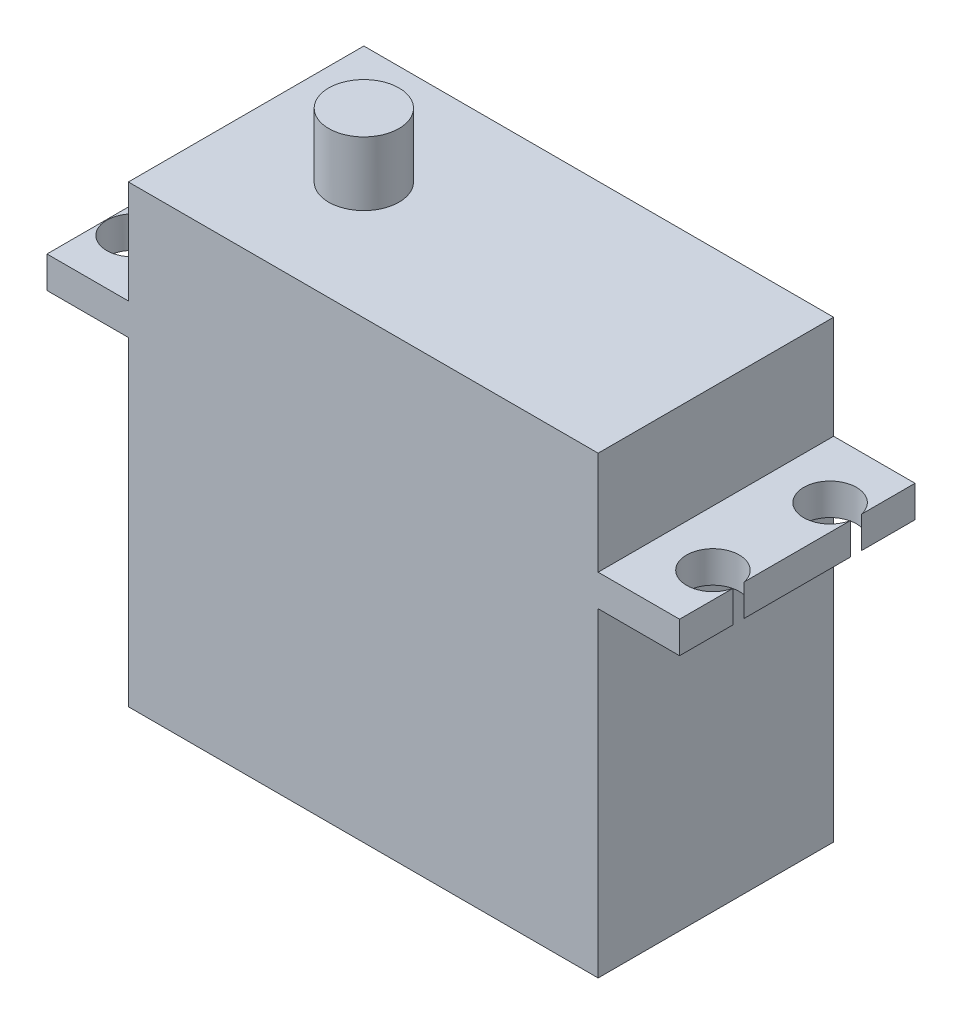
ISO-10303-21;
HEADER;
FILE_DESCRIPTION(('STEP AP214'),'2;1');
FILE_NAME('part.step','',(''),(''),'','','');
FILE_SCHEMA(('AUTOMOTIVE_DESIGN { 1 0 10303 214 1 1 1 1 }'));
ENDSEC;
DATA;
#1=APPLICATION_CONTEXT('core data for automotive mechanical design processes');
#2=APPLICATION_PROTOCOL_DEFINITION('international standard','automotive_design',2000,#1);
#3=PRODUCT_CONTEXT('',#1,'mechanical');
#4=PRODUCT('Part','Part','',(#3));
#5=PRODUCT_RELATED_PRODUCT_CATEGORY('part','',(#4));
#6=PRODUCT_DEFINITION_FORMATION('','',#4);
#7=PRODUCT_DEFINITION_CONTEXT('part definition',#1,'design');
#8=PRODUCT_DEFINITION('design','',#6,#7);
#9=PRODUCT_DEFINITION_SHAPE('','',#8);
#10=(LENGTH_UNIT() NAMED_UNIT(*) SI_UNIT(.MILLI.,.METRE.));
#11=(NAMED_UNIT(*) PLANE_ANGLE_UNIT() SI_UNIT($,.RADIAN.));
#12=(NAMED_UNIT(*) SI_UNIT($,.STERADIAN.) SOLID_ANGLE_UNIT());
#13=UNCERTAINTY_MEASURE_WITH_UNIT(LENGTH_MEASURE(1.E-05),#10,'distance_accuracy_value','');
#14=(GEOMETRIC_REPRESENTATION_CONTEXT(3) GLOBAL_UNCERTAINTY_ASSIGNED_CONTEXT((#13)) GLOBAL_UNIT_ASSIGNED_CONTEXT((#10,
#11,#12)) REPRESENTATION_CONTEXT('',''));
#15=CARTESIAN_POINT('',(0.,0.,0.));
#16=DIRECTION('',(0.,0.,1.));
#17=DIRECTION('',(1.,0.,0.));
#18=AXIS2_PLACEMENT_3D('',#15,#16,#17);
#19=CARTESIAN_POINT('',(-20.05,38.8,-10.05));
#20=DIRECTION('',(1.,0.,0.));
#21=DIRECTION('',(0.,0.,-1.));
#22=AXIS2_PLACEMENT_3D('',#19,#20,#21);
#23=PLANE('',#22);
#24=DIRECTION('',(0.,0.,1.));
#25=VECTOR('',#24,1.);
#26=CARTESIAN_POINT('',(-20.05,27.3,-10.05));
#27=LINE('',#26,#25);
#28=CARTESIAN_POINT('',(-20.05,27.3,-10.05));
#29=VERTEX_POINT('',#28);
#30=CARTESIAN_POINT('',(-20.05,27.3,10.05));
#31=VERTEX_POINT('',#30);
#32=EDGE_CURVE('E238',#29,#31,#27,.T.);
#33=ORIENTED_EDGE('',*,*,#32,.F.);
#34=DIRECTION('',(0.,-1.,0.));
#35=VECTOR('',#34,1.);
#36=CARTESIAN_POINT('',(-20.05,38.8,-10.05));
#37=LINE('',#36,#35);
#38=CARTESIAN_POINT('',(-20.05,0.,-10.05));
#39=VERTEX_POINT('',#38);
#40=EDGE_CURVE('E308',#29,#39,#37,.T.);
#41=ORIENTED_EDGE('',*,*,#40,.T.);
#42=DIRECTION('',(0.,0.,1.));
#43=VECTOR('',#42,1.);
#44=CARTESIAN_POINT('',(-20.05,0.,-10.05));
#45=LINE('',#44,#43);
#46=CARTESIAN_POINT('',(-20.05,0.,10.05));
#47=VERTEX_POINT('',#46);
#48=EDGE_CURVE('E297',#39,#47,#45,.T.);
#49=ORIENTED_EDGE('',*,*,#48,.T.);
#50=DIRECTION('',(0.,-1.,0.));
#51=VECTOR('',#50,1.);
#52=CARTESIAN_POINT('',(-20.05,38.8,10.05));
#53=LINE('',#52,#51);
#54=EDGE_CURVE('E304',#31,#47,#53,.T.);
#55=ORIENTED_EDGE('',*,*,#54,.F.);
#56=EDGE_LOOP('',(#33,#41,#49,#55));
#57=FACE_BOUND('',#56,.T.);
#58=DIRECTION('',(0.,1.,0.));
#59=VECTOR('',#58,1.);
#60=CARTESIAN_POINT('',(-20.05,11.,3.99999999999999));
#61=LINE('',#60,#59);
#62=CARTESIAN_POINT('',(-20.05,7.,3.99999999999999));
#63=VERTEX_POINT('',#62);
#64=CARTESIAN_POINT('',(-20.05,11.,3.99999999999999));
#65=VERTEX_POINT('',#64);
#66=EDGE_CURVE('E191',#63,#65,#61,.T.);
#67=ORIENTED_EDGE('',*,*,#66,.F.);
#68=DIRECTION('',(0.,0.,1.));
#69=VECTOR('',#68,1.);
#70=CARTESIAN_POINT('',(-20.05,7.,-4.00000000000001));
#71=LINE('',#70,#69);
#72=CARTESIAN_POINT('',(-20.05,7.,-4.00000000000001));
#73=VERTEX_POINT('',#72);
#74=EDGE_CURVE('E188',#73,#63,#71,.T.);
#75=ORIENTED_EDGE('',*,*,#74,.F.);
#76=DIRECTION('',(0.,-1.,0.));
#77=VECTOR('',#76,1.);
#78=CARTESIAN_POINT('',(-20.05,11.,-4.00000000000001));
#79=LINE('',#78,#77);
#80=CARTESIAN_POINT('',(-20.05,11.,-4.00000000000001));
#81=VERTEX_POINT('',#80);
#82=EDGE_CURVE('E54',#81,#73,#79,.T.);
#83=ORIENTED_EDGE('',*,*,#82,.F.);
#84=DIRECTION('',(0.,0.,-1.));
#85=VECTOR('',#84,1.);
#86=CARTESIAN_POINT('',(-20.05,11.,-4.00000000000001));
#87=LINE('',#86,#85);
#88=EDGE_CURVE('E49',#65,#81,#87,.T.);
#89=ORIENTED_EDGE('',*,*,#88,.F.);
#90=EDGE_LOOP('',(#67,#75,#83,#89));
#91=FACE_BOUND('',#90,.T.);
#92=ADVANCED_FACE('F34',(#57,#91),#23,.F.);
#93=CARTESIAN_POINT('',(27.,-57.6195279397532,-10.05));
#94=DIRECTION('',(-1.,0.,0.));
#95=DIRECTION('',(0.,0.,1.));
#96=AXIS2_PLACEMENT_3D('',#93,#94,#95);
#97=PLANE('',#96);
#98=DIRECTION('',(0.,0.,-1.));
#99=VECTOR('',#98,1.);
#100=CARTESIAN_POINT('',(27.,27.3,-10.05));
#101=LINE('',#100,#99);
#102=CARTESIAN_POINT('',(27.,27.3,10.05));
#103=VERTEX_POINT('',#102);
#104=CARTESIAN_POINT('',(27.,27.3,5.47169905660284));
#105=VERTEX_POINT('',#104);
#106=EDGE_CURVE('E226',#103,#105,#101,.T.);
#107=ORIENTED_EDGE('',*,*,#106,.T.);
#108=DIRECTION('',(0.,1.,0.));
#109=VECTOR('',#108,1.);
#110=CARTESIAN_POINT('',(27.,0.,5.47169905660284));
#111=LINE('',#110,#109);
#112=CARTESIAN_POINT('',(27.,30.,5.47169905660284));
#113=VERTEX_POINT('',#112);
#114=EDGE_CURVE('E12',#105,#113,#111,.T.);
#115=ORIENTED_EDGE('',*,*,#114,.T.);
#116=DIRECTION('',(0.,0.,1.));
#117=VECTOR('',#116,1.);
#118=CARTESIAN_POINT('',(27.,30.,-10.05));
#119=LINE('',#118,#117);
#120=CARTESIAN_POINT('',(27.,30.,10.05));
#121=VERTEX_POINT('',#120);
#122=EDGE_CURVE('E245',#113,#121,#119,.T.);
#123=ORIENTED_EDGE('',*,*,#122,.T.);
#124=DIRECTION('',(0.,1.,0.));
#125=VECTOR('',#124,1.);
#126=CARTESIAN_POINT('',(27.,-57.6195279397532,10.05));
#127=LINE('',#126,#125);
#128=EDGE_CURVE('E257',#103,#121,#127,.T.);
#129=ORIENTED_EDGE('',*,*,#128,.F.);
#130=EDGE_LOOP('',(#107,#115,#123,#129));
#131=FACE_BOUND('',#130,.T.);
#132=ADVANCED_FACE('F365',(#131),#97,.F.);
#133=CARTESIAN_POINT('',(27.,30.,-4.52830094339716));
#134=VERTEX_POINT('',#133);
#135=CARTESIAN_POINT('',(27.,30.,4.52830094339716));
#136=VERTEX_POINT('',#135);
#137=EDGE_CURVE('E250',#134,#136,#119,.T.);
#138=ORIENTED_EDGE('',*,*,#137,.T.);
#139=DIRECTION('',(0.,1.,0.));
#140=VECTOR('',#139,1.);
#141=CARTESIAN_POINT('',(27.,0.,4.52830094339716));
#142=LINE('',#141,#140);
#143=CARTESIAN_POINT('',(27.,27.3,4.52830094339716));
#144=VERTEX_POINT('',#143);
#145=EDGE_CURVE('E42',#136,#144,#142,.F.);
#146=ORIENTED_EDGE('',*,*,#145,.T.);
#147=CARTESIAN_POINT('',(27.,27.3,-4.52830094339716));
#148=VERTEX_POINT('',#147);
#149=EDGE_CURVE('E230',#144,#148,#101,.T.);
#150=ORIENTED_EDGE('',*,*,#149,.T.);
#151=DIRECTION('',(0.,1.,0.));
#152=VECTOR('',#151,1.);
#153=CARTESIAN_POINT('',(27.,0.,-4.52830094339716));
#154=LINE('',#153,#152);
#155=EDGE_CURVE('E318',#148,#134,#154,.T.);
#156=ORIENTED_EDGE('',*,*,#155,.T.);
#157=EDGE_LOOP('',(#138,#146,#150,#156));
#158=FACE_BOUND('',#157,.T.);
#159=ADVANCED_FACE('F325',(#158),#97,.F.);
#160=CARTESIAN_POINT('',(20.05,38.8,-10.05));
#161=DIRECTION('',(-1.,0.,0.));
#162=DIRECTION('',(0.,0.,1.));
#163=AXIS2_PLACEMENT_3D('',#160,#161,#162);
#164=PLANE('',#163);
#165=DIRECTION('',(0.,0.,1.));
#166=VECTOR('',#165,1.);
#167=CARTESIAN_POINT('',(20.05,30.,-10.05));
#168=LINE('',#167,#166);
#169=CARTESIAN_POINT('',(20.05,30.,-10.05));
#170=VERTEX_POINT('',#169);
#171=CARTESIAN_POINT('',(20.05,30.,10.05));
#172=VERTEX_POINT('',#171);
#173=EDGE_CURVE('E277',#170,#172,#168,.T.);
#174=ORIENTED_EDGE('',*,*,#173,.F.);
#175=DIRECTION('',(0.,-1.,0.));
#176=VECTOR('',#175,1.);
#177=CARTESIAN_POINT('',(20.05,38.8,-10.05));
#178=LINE('',#177,#176);
#179=CARTESIAN_POINT('',(20.05,38.8,-10.05));
#180=VERTEX_POINT('',#179);
#181=EDGE_CURVE('E312',#180,#170,#178,.T.);
#182=ORIENTED_EDGE('',*,*,#181,.F.);
#183=DIRECTION('',(0.,0.,-1.));
#184=VECTOR('',#183,1.);
#185=CARTESIAN_POINT('',(20.05,38.8,-10.05));
#186=LINE('',#185,#184);
#187=CARTESIAN_POINT('',(20.05,38.8,10.05));
#188=VERTEX_POINT('',#187);
#189=EDGE_CURVE('E281',#188,#180,#186,.T.);
#190=ORIENTED_EDGE('',*,*,#189,.F.);
#191=DIRECTION('',(0.,-1.,0.));
#192=VECTOR('',#191,1.);
#193=CARTESIAN_POINT('',(20.05,38.8,10.05));
#194=LINE('',#193,#192);
#195=EDGE_CURVE('E302',#188,#172,#194,.T.);
#196=ORIENTED_EDGE('',*,*,#195,.T.);
#197=EDGE_LOOP('',(#174,#182,#190,#196));
#198=FACE_BOUND('',#197,.T.);
#199=ADVANCED_FACE('F36',(#198),#164,.F.);
#200=DIRECTION('',(0.,0.,-1.));
#201=VECTOR('',#200,1.);
#202=CARTESIAN_POINT('',(20.05,27.3,-10.05));
#203=LINE('',#202,#201);
#204=CARTESIAN_POINT('',(20.05,27.3,10.05));
#205=VERTEX_POINT('',#204);
#206=CARTESIAN_POINT('',(20.05,27.3,-10.05));
#207=VERTEX_POINT('',#206);
#208=EDGE_CURVE('E271',#205,#207,#203,.T.);
#209=ORIENTED_EDGE('',*,*,#208,.F.);
#210=CARTESIAN_POINT('',(20.05,0.,10.05));
#211=VERTEX_POINT('',#210);
#212=EDGE_CURVE('E291',#205,#211,#194,.T.);
#213=ORIENTED_EDGE('',*,*,#212,.T.);
#214=DIRECTION('',(0.,0.,-1.));
#215=VECTOR('',#214,1.);
#216=CARTESIAN_POINT('',(20.05,0.,-10.05));
#217=LINE('',#216,#215);
#218=CARTESIAN_POINT('',(20.05,0.,-10.05));
#219=VERTEX_POINT('',#218);
#220=EDGE_CURVE('E280',#211,#219,#217,.T.);
#221=ORIENTED_EDGE('',*,*,#220,.T.);
#222=EDGE_CURVE('E311',#207,#219,#178,.T.);
#223=ORIENTED_EDGE('',*,*,#222,.F.);
#224=EDGE_LOOP('',(#209,#213,#221,#223));
#225=FACE_BOUND('',#224,.T.);
#226=ADVANCED_FACE('F376',(#225),#164,.F.);
#227=DIRECTION('',(0.,0.,-1.));
#228=VECTOR('',#227,1.);
#229=CARTESIAN_POINT('',(-20.05,30.,-10.05));
#230=LINE('',#229,#228);
#231=CARTESIAN_POINT('',(-20.05,30.,10.05));
#232=VERTEX_POINT('',#231);
#233=CARTESIAN_POINT('',(-20.05,30.,-10.05));
#234=VERTEX_POINT('',#233);
#235=EDGE_CURVE('E274',#232,#234,#230,.T.);
#236=ORIENTED_EDGE('',*,*,#235,.F.);
#237=CARTESIAN_POINT('',(-20.05,38.8,10.05));
#238=VERTEX_POINT('',#237);
#239=EDGE_CURVE('E305',#238,#232,#53,.T.);
#240=ORIENTED_EDGE('',*,*,#239,.F.);
#241=DIRECTION('',(0.,0.,1.));
#242=VECTOR('',#241,1.);
#243=CARTESIAN_POINT('',(-20.05,38.8,-10.05));
#244=LINE('',#243,#242);
#245=CARTESIAN_POINT('',(-20.05,38.8,-10.05));
#246=VERTEX_POINT('',#245);
#247=EDGE_CURVE('E287',#246,#238,#244,.T.);
#248=ORIENTED_EDGE('',*,*,#247,.F.);
#249=EDGE_CURVE('E309',#246,#234,#37,.T.);
#250=ORIENTED_EDGE('',*,*,#249,.T.);
#251=EDGE_LOOP('',(#236,#240,#248,#250));
#252=FACE_BOUND('',#251,.T.);
#253=ADVANCED_FACE('F368',(#252),#23,.F.);
#254=CARTESIAN_POINT('',(-20.05,38.8,-10.05));
#255=DIRECTION('',(0.,0.,1.));
#256=DIRECTION('',(1.,0.,0.));
#257=AXIS2_PLACEMENT_3D('',#254,#255,#256);
#258=PLANE('',#257);
#259=ORIENTED_EDGE('',*,*,#181,.T.);
#260=DIRECTION('',(1.,0.,0.));
#261=VECTOR('',#260,1.);
#262=CARTESIAN_POINT('',(27.,30.,-10.05));
#263=LINE('',#262,#261);
#264=CARTESIAN_POINT('',(27.,30.,-10.05));
#265=VERTEX_POINT('',#264);
#266=EDGE_CURVE('E241',#170,#265,#263,.T.);
#267=ORIENTED_EDGE('',*,*,#266,.T.);
#268=DIRECTION('',(0.,1.,0.));
#269=VECTOR('',#268,1.);
#270=CARTESIAN_POINT('',(27.,-57.6195279397532,-10.05));
#271=LINE('',#270,#269);
#272=CARTESIAN_POINT('',(27.,27.3,-10.05));
#273=VERTEX_POINT('',#272);
#274=EDGE_CURVE('E260',#273,#265,#271,.T.);
#275=ORIENTED_EDGE('',*,*,#274,.F.);
#276=DIRECTION('',(-1.,0.,0.));
#277=VECTOR('',#276,1.);
#278=CARTESIAN_POINT('',(27.,27.3,-10.05));
#279=LINE('',#278,#277);
#280=EDGE_CURVE('E232',#273,#207,#279,.T.);
#281=ORIENTED_EDGE('',*,*,#280,.T.);
#282=ORIENTED_EDGE('',*,*,#222,.T.);
#283=DIRECTION('',(-1.,0.,0.));
#284=VECTOR('',#283,1.);
#285=CARTESIAN_POINT('',(-20.05,0.,-10.05));
#286=LINE('',#285,#284);
#287=EDGE_CURVE('E294',#219,#39,#286,.T.);
#288=ORIENTED_EDGE('',*,*,#287,.T.);
#289=ORIENTED_EDGE('',*,*,#40,.F.);
#290=CARTESIAN_POINT('',(-27.,27.3,-10.05));
#291=VERTEX_POINT('',#290);
#292=EDGE_CURVE('E229',#29,#291,#279,.T.);
#293=ORIENTED_EDGE('',*,*,#292,.T.);
#294=DIRECTION('',(0.,1.,0.));
#295=VECTOR('',#294,1.);
#296=CARTESIAN_POINT('',(-27.,-57.6195279397532,-10.05));
#297=LINE('',#296,#295);
#298=CARTESIAN_POINT('',(-27.,30.,-10.05));
#299=VERTEX_POINT('',#298);
#300=EDGE_CURVE('E263',#291,#299,#297,.T.);
#301=ORIENTED_EDGE('',*,*,#300,.T.);
#302=EDGE_CURVE('E242',#299,#234,#263,.T.);
#303=ORIENTED_EDGE('',*,*,#302,.T.);
#304=ORIENTED_EDGE('',*,*,#249,.F.);
#305=DIRECTION('',(-1.,0.,0.));
#306=VECTOR('',#305,1.);
#307=CARTESIAN_POINT('',(-20.05,38.8,-10.05));
#308=LINE('',#307,#306);
#309=EDGE_CURVE('E284',#180,#246,#308,.T.);
#310=ORIENTED_EDGE('',*,*,#309,.F.);
#311=EDGE_LOOP('',(#259,#267,#275,#281,#282,#288,#289,#293,#301,#303,#304,#310));
#312=FACE_BOUND('',#311,.T.);
#313=ADVANCED_FACE('F340',(#312),#258,.F.);
#314=CARTESIAN_POINT('',(-20.05,38.8,10.05));
#315=DIRECTION('',(0.,0.,-1.));
#316=DIRECTION('',(-1.,0.,0.));
#317=AXIS2_PLACEMENT_3D('',#314,#315,#316);
#318=PLANE('',#317);
#319=ORIENTED_EDGE('',*,*,#212,.F.);
#320=DIRECTION('',(1.,0.,0.));
#321=VECTOR('',#320,1.);
#322=CARTESIAN_POINT('',(27.,27.3,10.05));
#323=LINE('',#322,#321);
#324=EDGE_CURVE('E265',#205,#103,#323,.T.);
#325=ORIENTED_EDGE('',*,*,#324,.T.);
#326=ORIENTED_EDGE('',*,*,#128,.T.);
#327=DIRECTION('',(-1.,0.,0.));
#328=VECTOR('',#327,1.);
#329=CARTESIAN_POINT('',(27.,30.,10.05));
#330=LINE('',#329,#328);
#331=EDGE_CURVE('E251',#121,#172,#330,.T.);
#332=ORIENTED_EDGE('',*,*,#331,.T.);
#333=ORIENTED_EDGE('',*,*,#195,.F.);
#334=DIRECTION('',(1.,0.,0.));
#335=VECTOR('',#334,1.);
#336=CARTESIAN_POINT('',(-20.05,38.8,10.05));
#337=LINE('',#336,#335);
#338=EDGE_CURVE('E289',#238,#188,#337,.T.);
#339=ORIENTED_EDGE('',*,*,#338,.F.);
#340=ORIENTED_EDGE('',*,*,#239,.T.);
#341=CARTESIAN_POINT('',(-27.,30.,10.05));
#342=VERTEX_POINT('',#341);
#343=EDGE_CURVE('E249',#232,#342,#330,.T.);
#344=ORIENTED_EDGE('',*,*,#343,.T.);
#345=DIRECTION('',(0.,1.,0.));
#346=VECTOR('',#345,1.);
#347=CARTESIAN_POINT('',(-27.,-57.6195279397532,10.05));
#348=LINE('',#347,#346);
#349=CARTESIAN_POINT('',(-27.,27.3,10.05));
#350=VERTEX_POINT('',#349);
#351=EDGE_CURVE('E254',#350,#342,#348,.T.);
#352=ORIENTED_EDGE('',*,*,#351,.F.);
#353=EDGE_CURVE('E266',#350,#31,#323,.T.);
#354=ORIENTED_EDGE('',*,*,#353,.T.);
#355=ORIENTED_EDGE('',*,*,#54,.T.);
#356=DIRECTION('',(1.,0.,0.));
#357=VECTOR('',#356,1.);
#358=CARTESIAN_POINT('',(-20.05,0.,10.05));
#359=LINE('',#358,#357);
#360=EDGE_CURVE('E285',#47,#211,#359,.T.);
#361=ORIENTED_EDGE('',*,*,#360,.T.);
#362=EDGE_LOOP('',(#319,#325,#326,#332,#333,#339,#340,#344,#352,#354,#355,#361));
#363=FACE_BOUND('',#362,.T.);
#364=ADVANCED_FACE('F382',(#363),#318,.F.);
#365=CARTESIAN_POINT('',(0.,38.8,0.));
#366=DIRECTION('',(0.,1.,0.));
#367=DIRECTION('',(0.,0.,1.));
#368=AXIS2_PLACEMENT_3D('',#365,#366,#367);
#369=PLANE('',#368);
#370=CARTESIAN_POINT('',(-10.,38.8,0.));
#371=DIRECTION('',(0.,1.,0.));
#372=DIRECTION('',(0.,0.,1.));
#373=AXIS2_PLACEMENT_3D('',#370,#371,#372);
#374=CIRCLE('',#373,3.);
#375=CARTESIAN_POINT('',(-10.,38.8,3.));
#376=VERTEX_POINT('',#375);
#377=EDGE_CURVE('E219',#376,#376,#374,.T.);
#378=ORIENTED_EDGE('',*,*,#377,.F.);
#379=EDGE_LOOP('',(#378));
#380=FACE_BOUND('',#379,.T.);
#381=ORIENTED_EDGE('',*,*,#189,.T.);
#382=ORIENTED_EDGE('',*,*,#309,.T.);
#383=ORIENTED_EDGE('',*,*,#247,.T.);
#384=ORIENTED_EDGE('',*,*,#338,.T.);
#385=EDGE_LOOP('',(#381,#382,#383,#384));
#386=FACE_BOUND('',#385,.T.);
#387=ADVANCED_FACE('F415',(#380,#386),#369,.T.);
#388=CARTESIAN_POINT('',(0.,0.,0.));
#389=DIRECTION('',(0.,1.,0.));
#390=DIRECTION('',(0.,0.,1.));
#391=AXIS2_PLACEMENT_3D('',#388,#389,#390);
#392=PLANE('',#391);
#393=ORIENTED_EDGE('',*,*,#220,.F.);
#394=ORIENTED_EDGE('',*,*,#360,.F.);
#395=ORIENTED_EDGE('',*,*,#48,.F.);
#396=ORIENTED_EDGE('',*,*,#287,.F.);
#397=EDGE_LOOP('',(#393,#394,#395,#396));
#398=FACE_BOUND('',#397,.T.);
#399=ADVANCED_FACE('F410',(#398),#392,.F.);
#400=CARTESIAN_POINT('',(-27.,-57.6195279397532,-10.05));
#401=DIRECTION('',(1.,0.,0.));
#402=DIRECTION('',(0.,0.,-1.));
#403=AXIS2_PLACEMENT_3D('',#400,#401,#402);
#404=PLANE('',#403);
#405=ORIENTED_EDGE('',*,*,#300,.F.);
#406=DIRECTION('',(0.,0.,1.));
#407=VECTOR('',#406,1.);
#408=CARTESIAN_POINT('',(-27.,27.3,-10.05));
#409=LINE('',#408,#407);
#410=EDGE_CURVE('E235',#291,#350,#409,.T.);
#411=ORIENTED_EDGE('',*,*,#410,.T.);
#412=ORIENTED_EDGE('',*,*,#351,.T.);
#413=DIRECTION('',(0.,0.,-1.));
#414=VECTOR('',#413,1.);
#415=CARTESIAN_POINT('',(-27.,30.,-10.05));
#416=LINE('',#415,#414);
#417=EDGE_CURVE('E225',#342,#299,#416,.T.);
#418=ORIENTED_EDGE('',*,*,#417,.T.);
#419=EDGE_LOOP('',(#405,#411,#412,#418));
#420=FACE_BOUND('',#419,.T.);
#421=ADVANCED_FACE('F399',(#420),#404,.F.);
#422=CARTESIAN_POINT('',(0.,27.3,0.));
#423=DIRECTION('',(0.,1.,0.));
#424=DIRECTION('',(0.,0.,1.));
#425=AXIS2_PLACEMENT_3D('',#422,#423,#424);
#426=PLANE('',#425);
#427=CARTESIAN_POINT('',(-24.7,27.3,-5.));
#428=DIRECTION('',(0.,1.,0.));
#429=DIRECTION('',(0.,0.,1.));
#430=AXIS2_PLACEMENT_3D('',#427,#428,#429);
#431=CIRCLE('',#430,2.25);
#432=CARTESIAN_POINT('',(-24.7,27.3,-2.75));
#433=VERTEX_POINT('',#432);
#434=EDGE_CURVE('E216',#433,#433,#431,.T.);
#435=ORIENTED_EDGE('',*,*,#434,.T.);
#436=EDGE_LOOP('',(#435));
#437=FACE_BOUND('',#436,.T.);
#438=CARTESIAN_POINT('',(-24.7,27.3,5.));
#439=DIRECTION('',(0.,1.,0.));
#440=DIRECTION('',(0.,0.,1.));
#441=AXIS2_PLACEMENT_3D('',#438,#439,#440);
#442=CIRCLE('',#441,2.25);
#443=CARTESIAN_POINT('',(-24.7,27.3,7.25));
#444=VERTEX_POINT('',#443);
#445=EDGE_CURVE('E213',#444,#444,#442,.T.);
#446=ORIENTED_EDGE('',*,*,#445,.T.);
#447=EDGE_LOOP('',(#446));
#448=FACE_BOUND('',#447,.T.);
#449=ORIENTED_EDGE('',*,*,#292,.F.);
#450=ORIENTED_EDGE('',*,*,#32,.T.);
#451=ORIENTED_EDGE('',*,*,#353,.F.);
#452=ORIENTED_EDGE('',*,*,#410,.F.);
#453=EDGE_LOOP('',(#449,#450,#451,#452));
#454=FACE_BOUND('',#453,.T.);
#455=ADVANCED_FACE('F403',(#437,#448,#454),#426,.F.);
#456=CARTESIAN_POINT('',(0.,30.,0.));
#457=DIRECTION('',(0.,-1.,0.));
#458=DIRECTION('',(0.,0.,-1.));
#459=AXIS2_PLACEMENT_3D('',#456,#457,#458);
#460=PLANE('',#459);
#461=CARTESIAN_POINT('',(-24.7,30.,-5.));
#462=DIRECTION('',(0.,1.,0.));
#463=DIRECTION('',(0.,0.,1.));
#464=AXIS2_PLACEMENT_3D('',#461,#462,#463);
#465=CIRCLE('',#464,2.25);
#466=CARTESIAN_POINT('',(-24.7,30.,-2.75));
#467=VERTEX_POINT('',#466);
#468=EDGE_CURVE('E195',#467,#467,#465,.T.);
#469=ORIENTED_EDGE('',*,*,#468,.F.);
#470=EDGE_LOOP('',(#469));
#471=FACE_BOUND('',#470,.T.);
#472=CARTESIAN_POINT('',(-24.7,30.,5.));
#473=DIRECTION('',(0.,1.,0.));
#474=DIRECTION('',(0.,0.,-1.));
#475=AXIS2_PLACEMENT_3D('',#472,#473,#474);
#476=CIRCLE('',#475,2.25);
#477=CARTESIAN_POINT('',(-24.7,30.,2.75));
#478=VERTEX_POINT('',#477);
#479=EDGE_CURVE('E192',#478,#478,#476,.T.);
#480=ORIENTED_EDGE('',*,*,#479,.F.);
#481=EDGE_LOOP('',(#480));
#482=FACE_BOUND('',#481,.T.);
#483=ORIENTED_EDGE('',*,*,#343,.F.);
#484=ORIENTED_EDGE('',*,*,#235,.T.);
#485=ORIENTED_EDGE('',*,*,#302,.F.);
#486=ORIENTED_EDGE('',*,*,#417,.F.);
#487=EDGE_LOOP('',(#483,#484,#485,#486));
#488=FACE_BOUND('',#487,.T.);
#489=ADVANCED_FACE('F396',(#471,#482,#488),#460,.F.);
#490=ORIENTED_EDGE('',*,*,#122,.F.);
#491=CARTESIAN_POINT('',(24.8,30.,5.));
#492=DIRECTION('',(0.,1.,0.));
#493=DIRECTION('',(0.,0.,-1.));
#494=AXIS2_PLACEMENT_3D('',#491,#492,#493);
#495=CIRCLE('',#494,2.25);
#496=EDGE_CURVE('E201',#136,#113,#495,.T.);
#497=ORIENTED_EDGE('',*,*,#496,.F.);
#498=ORIENTED_EDGE('',*,*,#137,.F.);
#499=CARTESIAN_POINT('',(24.8,30.,-5.));
#500=DIRECTION('',(0.,1.,0.));
#501=DIRECTION('',(0.,0.,1.));
#502=AXIS2_PLACEMENT_3D('',#499,#500,#501);
#503=CIRCLE('',#502,2.25);
#504=CARTESIAN_POINT('',(27.,30.,-5.47169905660284));
#505=VERTEX_POINT('',#504);
#506=EDGE_CURVE('E203',#505,#134,#503,.T.);
#507=ORIENTED_EDGE('',*,*,#506,.F.);
#508=EDGE_CURVE('E246',#265,#505,#119,.T.);
#509=ORIENTED_EDGE('',*,*,#508,.F.);
#510=ORIENTED_EDGE('',*,*,#266,.F.);
#511=ORIENTED_EDGE('',*,*,#173,.T.);
#512=ORIENTED_EDGE('',*,*,#331,.F.);
#513=EDGE_LOOP('',(#490,#497,#498,#507,#509,#510,#511,#512));
#514=FACE_BOUND('',#513,.T.);
#515=ADVANCED_FACE('F345',(#514),#460,.F.);
#516=ORIENTED_EDGE('',*,*,#149,.F.);
#517=CARTESIAN_POINT('',(24.8,27.3,5.));
#518=DIRECTION('',(0.,1.,0.));
#519=DIRECTION('',(0.,0.,1.));
#520=AXIS2_PLACEMENT_3D('',#517,#518,#519);
#521=CIRCLE('',#520,2.25);
#522=EDGE_CURVE('E210',#144,#105,#521,.T.);
#523=ORIENTED_EDGE('',*,*,#522,.T.);
#524=ORIENTED_EDGE('',*,*,#106,.F.);
#525=ORIENTED_EDGE('',*,*,#324,.F.);
#526=ORIENTED_EDGE('',*,*,#208,.T.);
#527=ORIENTED_EDGE('',*,*,#280,.F.);
#528=CARTESIAN_POINT('',(27.,27.3,-5.47169905660284));
#529=VERTEX_POINT('',#528);
#530=EDGE_CURVE('E231',#529,#273,#101,.T.);
#531=ORIENTED_EDGE('',*,*,#530,.F.);
#532=CARTESIAN_POINT('',(24.8,27.3,-5.));
#533=DIRECTION('',(0.,1.,0.));
#534=DIRECTION('',(0.,0.,1.));
#535=AXIS2_PLACEMENT_3D('',#532,#533,#534);
#536=CIRCLE('',#535,2.25);
#537=EDGE_CURVE('E207',#529,#148,#536,.T.);
#538=ORIENTED_EDGE('',*,*,#537,.T.);
#539=EDGE_LOOP('',(#516,#523,#524,#525,#526,#527,#531,#538));
#540=FACE_BOUND('',#539,.T.);
#541=ADVANCED_FACE('F330',(#540),#426,.F.);
#542=ORIENTED_EDGE('',*,*,#508,.T.);
#543=DIRECTION('',(0.,1.,0.));
#544=VECTOR('',#543,1.);
#545=CARTESIAN_POINT('',(27.,0.,-5.47169905660284));
#546=LINE('',#545,#544);
#547=EDGE_CURVE('E315',#505,#529,#546,.F.);
#548=ORIENTED_EDGE('',*,*,#547,.T.);
#549=ORIENTED_EDGE('',*,*,#530,.T.);
#550=ORIENTED_EDGE('',*,*,#274,.T.);
#551=EDGE_LOOP('',(#542,#548,#549,#550));
#552=FACE_BOUND('',#551,.T.);
#553=ADVANCED_FACE('F335',(#552),#97,.F.);
#554=CARTESIAN_POINT('',(-10.,52.7352813742386,0.));
#555=DIRECTION('',(0.,-1.,0.));
#556=DIRECTION('',(0.,0.,-1.));
#557=AXIS2_PLACEMENT_3D('',#554,#555,#556);
#558=CYLINDRICAL_SURFACE('',#557,3.);
#559=CARTESIAN_POINT('',(-10.,44.25,0.));
#560=DIRECTION('',(0.,-1.,0.));
#561=DIRECTION('',(0.,0.,-1.));
#562=AXIS2_PLACEMENT_3D('',#559,#560,#561);
#563=CIRCLE('',#562,3.);
#564=CARTESIAN_POINT('',(-10.,44.25,-3.));
#565=VERTEX_POINT('',#564);
#566=EDGE_CURVE('E222',#565,#565,#563,.T.);
#567=ORIENTED_EDGE('',*,*,#566,.T.);
#568=EDGE_LOOP('',(#567));
#569=FACE_BOUND('',#568,.T.);
#570=ORIENTED_EDGE('',*,*,#377,.T.);
#571=EDGE_LOOP('',(#570));
#572=FACE_BOUND('',#571,.T.);
#573=ADVANCED_FACE('F360',(#569,#572),#558,.T.);
#574=CARTESIAN_POINT('',(0.,44.25,0.));
#575=DIRECTION('',(0.,-1.,0.));
#576=DIRECTION('',(0.,0.,-1.));
#577=AXIS2_PLACEMENT_3D('',#574,#575,#576);
#578=PLANE('',#577);
#579=ORIENTED_EDGE('',*,*,#566,.F.);
#580=EDGE_LOOP('',(#579));
#581=FACE_BOUND('',#580,.T.);
#582=ADVANCED_FACE('F352',(#581),#578,.F.);
#583=CARTESIAN_POINT('',(24.8,0.,-5.));
#584=DIRECTION('',(0.,1.,0.));
#585=DIRECTION('',(0.,0.,1.));
#586=AXIS2_PLACEMENT_3D('',#583,#584,#585);
#587=CYLINDRICAL_SURFACE('',#586,2.25);
#588=ORIENTED_EDGE('',*,*,#537,.F.);
#589=ORIENTED_EDGE('',*,*,#547,.F.);
#590=ORIENTED_EDGE('',*,*,#506,.T.);
#591=ORIENTED_EDGE('',*,*,#155,.F.);
#592=EDGE_LOOP('',(#588,#589,#590,#591));
#593=FACE_BOUND('',#592,.T.);
#594=ADVANCED_FACE('F349',(#593),#587,.F.);
#595=CARTESIAN_POINT('',(24.8,0.,5.));
#596=DIRECTION('',(0.,1.,0.));
#597=DIRECTION('',(0.,0.,1.));
#598=AXIS2_PLACEMENT_3D('',#595,#596,#597);
#599=CYLINDRICAL_SURFACE('',#598,2.25);
#600=ORIENTED_EDGE('',*,*,#522,.F.);
#601=ORIENTED_EDGE('',*,*,#145,.F.);
#602=ORIENTED_EDGE('',*,*,#496,.T.);
#603=ORIENTED_EDGE('',*,*,#114,.F.);
#604=EDGE_LOOP('',(#600,#601,#602,#603));
#605=FACE_BOUND('',#604,.T.);
#606=ADVANCED_FACE('F351',(#605),#599,.F.);
#607=CARTESIAN_POINT('',(-24.7,0.,5.));
#608=DIRECTION('',(0.,1.,0.));
#609=DIRECTION('',(0.,0.,1.));
#610=AXIS2_PLACEMENT_3D('',#607,#608,#609);
#611=CYLINDRICAL_SURFACE('',#610,2.25);
#612=ORIENTED_EDGE('',*,*,#479,.T.);
#613=EDGE_LOOP('',(#612));
#614=FACE_BOUND('',#613,.T.);
#615=ORIENTED_EDGE('',*,*,#445,.F.);
#616=EDGE_LOOP('',(#615));
#617=FACE_BOUND('',#616,.T.);
#618=ADVANCED_FACE('F358',(#614,#617),#611,.F.);
#619=CARTESIAN_POINT('',(-24.7,0.,-5.));
#620=DIRECTION('',(0.,1.,0.));
#621=DIRECTION('',(0.,0.,1.));
#622=AXIS2_PLACEMENT_3D('',#619,#620,#621);
#623=CYLINDRICAL_SURFACE('',#622,2.25);
#624=ORIENTED_EDGE('',*,*,#468,.T.);
#625=EDGE_LOOP('',(#624));
#626=FACE_BOUND('',#625,.T.);
#627=ORIENTED_EDGE('',*,*,#434,.F.);
#628=EDGE_LOOP('',(#627));
#629=FACE_BOUND('',#628,.T.);
#630=ADVANCED_FACE('F511',(#626,#629),#623,.F.);
#631=CARTESIAN_POINT('',(-23.05,11.,3.99999999999999));
#632=DIRECTION('',(0.,0.,-1.));
#633=DIRECTION('',(-1.,0.,0.));
#634=AXIS2_PLACEMENT_3D('',#631,#632,#633);
#635=PLANE('',#634);
#636=ORIENTED_EDGE('',*,*,#66,.T.);
#637=DIRECTION('',(1.,0.,0.));
#638=VECTOR('',#637,1.);
#639=CARTESIAN_POINT('',(-23.05,11.,3.99999999999999));
#640=LINE('',#639,#638);
#641=CARTESIAN_POINT('',(-23.05,11.,3.99999999999999));
#642=VERTEX_POINT('',#641);
#643=EDGE_CURVE('E172',#642,#65,#640,.T.);
#644=ORIENTED_EDGE('',*,*,#643,.F.);
#645=DIRECTION('',(0.,1.,0.));
#646=VECTOR('',#645,1.);
#647=CARTESIAN_POINT('',(-23.05,11.,3.99999999999999));
#648=LINE('',#647,#646);
#649=CARTESIAN_POINT('',(-23.05,7.,3.99999999999999));
#650=VERTEX_POINT('',#649);
#651=EDGE_CURVE('E179',#650,#642,#648,.T.);
#652=ORIENTED_EDGE('',*,*,#651,.F.);
#653=DIRECTION('',(1.,0.,0.));
#654=VECTOR('',#653,1.);
#655=CARTESIAN_POINT('',(-23.05,7.,3.99999999999999));
#656=LINE('',#655,#654);
#657=EDGE_CURVE('E574',#650,#63,#656,.T.);
#658=ORIENTED_EDGE('',*,*,#657,.T.);
#659=EDGE_LOOP('',(#636,#644,#652,#658));
#660=FACE_BOUND('',#659,.T.);
#661=ADVANCED_FACE('F190',(#660),#635,.F.);
#662=CARTESIAN_POINT('',(-23.05,11.,-4.00000000000001));
#663=DIRECTION('',(0.,-1.,0.));
#664=DIRECTION('',(0.,0.,-1.));
#665=AXIS2_PLACEMENT_3D('',#662,#663,#664);
#666=PLANE('',#665);
#667=ORIENTED_EDGE('',*,*,#88,.T.);
#668=DIRECTION('',(1.,0.,0.));
#669=VECTOR('',#668,1.);
#670=CARTESIAN_POINT('',(-23.05,11.,-4.00000000000001));
#671=LINE('',#670,#669);
#672=CARTESIAN_POINT('',(-23.05,11.,-4.00000000000001));
#673=VERTEX_POINT('',#672);
#674=EDGE_CURVE('E175',#673,#81,#671,.T.);
#675=ORIENTED_EDGE('',*,*,#674,.F.);
#676=DIRECTION('',(0.,0.,-1.));
#677=VECTOR('',#676,1.);
#678=CARTESIAN_POINT('',(-23.05,11.,-4.00000000000001));
#679=LINE('',#678,#677);
#680=EDGE_CURVE('E168',#642,#673,#679,.T.);
#681=ORIENTED_EDGE('',*,*,#680,.F.);
#682=ORIENTED_EDGE('',*,*,#643,.T.);
#683=EDGE_LOOP('',(#667,#675,#681,#682));
#684=FACE_BOUND('',#683,.T.);
#685=ADVANCED_FACE('F170',(#684),#666,.F.);
#686=CARTESIAN_POINT('',(-23.05,11.,-4.00000000000001));
#687=DIRECTION('',(0.,0.,1.));
#688=DIRECTION('',(1.,0.,0.));
#689=AXIS2_PLACEMENT_3D('',#686,#687,#688);
#690=PLANE('',#689);
#691=ORIENTED_EDGE('',*,*,#82,.T.);
#692=DIRECTION('',(1.,0.,0.));
#693=VECTOR('',#692,1.);
#694=CARTESIAN_POINT('',(-23.05,7.,-4.00000000000001));
#695=LINE('',#694,#693);
#696=CARTESIAN_POINT('',(-23.05,7.,-4.00000000000001));
#697=VERTEX_POINT('',#696);
#698=EDGE_CURVE('E197',#697,#73,#695,.T.);
#699=ORIENTED_EDGE('',*,*,#698,.F.);
#700=DIRECTION('',(0.,-1.,0.));
#701=VECTOR('',#700,1.);
#702=CARTESIAN_POINT('',(-23.05,11.,-4.00000000000001));
#703=LINE('',#702,#701);
#704=EDGE_CURVE('E178',#673,#697,#703,.T.);
#705=ORIENTED_EDGE('',*,*,#704,.F.);
#706=ORIENTED_EDGE('',*,*,#674,.T.);
#707=EDGE_LOOP('',(#691,#699,#705,#706));
#708=FACE_BOUND('',#707,.T.);
#709=ADVANCED_FACE('F541',(#708),#690,.F.);
#710=CARTESIAN_POINT('',(-23.05,7.,-4.00000000000001));
#711=DIRECTION('',(0.,1.,0.));
#712=DIRECTION('',(0.,0.,1.));
#713=AXIS2_PLACEMENT_3D('',#710,#711,#712);
#714=PLANE('',#713);
#715=ORIENTED_EDGE('',*,*,#74,.T.);
#716=ORIENTED_EDGE('',*,*,#657,.F.);
#717=DIRECTION('',(0.,0.,1.));
#718=VECTOR('',#717,1.);
#719=CARTESIAN_POINT('',(-23.05,7.,-4.00000000000001));
#720=LINE('',#719,#718);
#721=EDGE_CURVE('E184',#697,#650,#720,.T.);
#722=ORIENTED_EDGE('',*,*,#721,.F.);
#723=ORIENTED_EDGE('',*,*,#698,.T.);
#724=EDGE_LOOP('',(#715,#716,#722,#723));
#725=FACE_BOUND('',#724,.T.);
#726=ADVANCED_FACE('F550',(#725),#714,.F.);
#727=CARTESIAN_POINT('',(-23.05,0.,0.));
#728=DIRECTION('',(-1.,0.,0.));
#729=DIRECTION('',(0.,0.,1.));
#730=AXIS2_PLACEMENT_3D('',#727,#728,#729);
#731=PLANE('',#730);
#732=ORIENTED_EDGE('',*,*,#651,.T.);
#733=ORIENTED_EDGE('',*,*,#680,.T.);
#734=ORIENTED_EDGE('',*,*,#704,.T.);
#735=ORIENTED_EDGE('',*,*,#721,.T.);
#736=EDGE_LOOP('',(#732,#733,#734,#735));
#737=FACE_BOUND('',#736,.T.);
#738=ADVANCED_FACE('F182',(#737),#731,.T.);
#739=CLOSED_SHELL('',(#92,#132,#159,#199,#226,#253,#313,#364,#387,#399,#421,#455,#489,#515,#541,
#553,#573,#582,#594,#606,#618,#630,#661,#685,#709,#726,#738));
#740=MANIFOLD_SOLID_BREP('B2',#739);
#741=ADVANCED_BREP_SHAPE_REPRESENTATION('',(#18,#740),#14);
#742=SHAPE_DEFINITION_REPRESENTATION(#9,#741);
ENDSEC;
END-ISO-10303-21;
